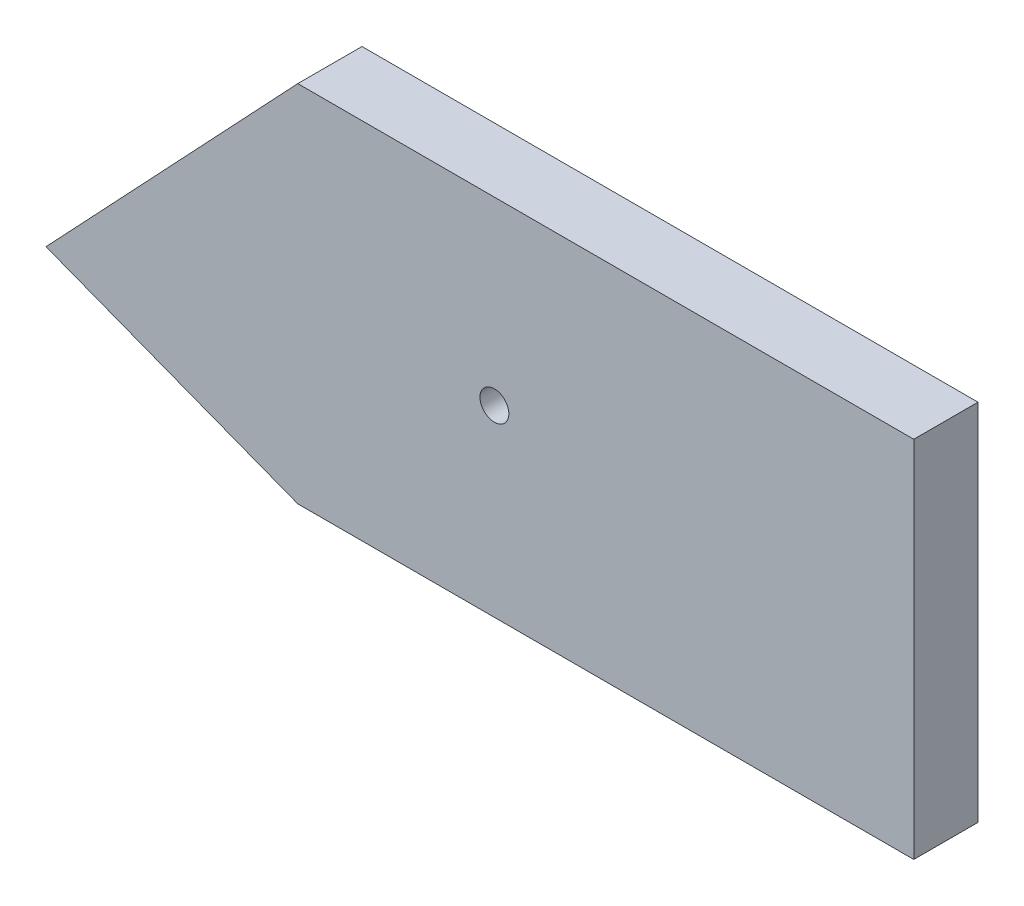
ISO-10303-21;
HEADER;
FILE_DESCRIPTION(('STEP AP214'),'2;1');
FILE_NAME('part.step','',(''),(''),'','','');
FILE_SCHEMA(('AUTOMOTIVE_DESIGN { 1 0 10303 214 1 1 1 1 }'));
ENDSEC;
DATA;
#1=APPLICATION_CONTEXT('core data for automotive mechanical design processes');
#2=APPLICATION_PROTOCOL_DEFINITION('international standard','automotive_design',2000,#1);
#3=PRODUCT_CONTEXT('',#1,'mechanical');
#4=PRODUCT('Part','Part','',(#3));
#5=PRODUCT_RELATED_PRODUCT_CATEGORY('part','',(#4));
#6=PRODUCT_DEFINITION_FORMATION('','',#4);
#7=PRODUCT_DEFINITION_CONTEXT('part definition',#1,'design');
#8=PRODUCT_DEFINITION('design','',#6,#7);
#9=PRODUCT_DEFINITION_SHAPE('','',#8);
#10=(LENGTH_UNIT() NAMED_UNIT(*) SI_UNIT(.MILLI.,.METRE.));
#11=(NAMED_UNIT(*) PLANE_ANGLE_UNIT() SI_UNIT($,.RADIAN.));
#12=(NAMED_UNIT(*) SI_UNIT($,.STERADIAN.) SOLID_ANGLE_UNIT());
#13=UNCERTAINTY_MEASURE_WITH_UNIT(LENGTH_MEASURE(1.E-05),#10,'distance_accuracy_value','');
#14=(GEOMETRIC_REPRESENTATION_CONTEXT(3) GLOBAL_UNCERTAINTY_ASSIGNED_CONTEXT((#13)) GLOBAL_UNIT_ASSIGNED_CONTEXT((#10,
#11,#12)) REPRESENTATION_CONTEXT('',''));
#15=CARTESIAN_POINT('',(0.,0.,0.));
#16=DIRECTION('',(0.,0.,1.));
#17=DIRECTION('',(1.,0.,0.));
#18=AXIS2_PLACEMENT_3D('',#15,#16,#17);
#19=CARTESIAN_POINT('',(-460.979412648812,-194.929034047607,10.));
#20=DIRECTION('',(-1.,0.,0.));
#21=DIRECTION('',(0.,0.,1.));
#22=AXIS2_PLACEMENT_3D('',#19,#20,#21);
#23=PLANE('',#22);
#24=DIRECTION('',(0.,1.,0.));
#25=VECTOR('',#24,1.);
#26=CARTESIAN_POINT('',(-460.979412648812,-194.929034047607,0.));
#27=LINE('',#26,#25);
#28=CARTESIAN_POINT('',(-460.979412648812,-194.929034047607,0.));
#29=VERTEX_POINT('',#28);
#30=CARTESIAN_POINT('',(-460.979412648812,-138.268279633482,0.));
#31=VERTEX_POINT('',#30);
#32=EDGE_CURVE('E120',#29,#31,#27,.T.);
#33=ORIENTED_EDGE('',*,*,#32,.T.);
#34=DIRECTION('',(0.,0.,-1.));
#35=VECTOR('',#34,1.);
#36=CARTESIAN_POINT('',(-460.979412648812,-138.268279633482,10.));
#37=LINE('',#36,#35);
#38=CARTESIAN_POINT('',(-460.979412648812,-138.268279633482,10.));
#39=VERTEX_POINT('',#38);
#40=EDGE_CURVE('E11',#39,#31,#37,.T.);
#41=ORIENTED_EDGE('',*,*,#40,.F.);
#42=DIRECTION('',(0.,1.,0.));
#43=VECTOR('',#42,1.);
#44=CARTESIAN_POINT('',(-460.979412648812,-194.929034047607,10.));
#45=LINE('',#44,#43);
#46=CARTESIAN_POINT('',(-460.979412648812,-194.929034047607,10.));
#47=VERTEX_POINT('',#46);
#48=EDGE_CURVE('E134',#47,#39,#45,.T.);
#49=ORIENTED_EDGE('',*,*,#48,.F.);
#50=DIRECTION('',(0.,0.,-1.));
#51=VECTOR('',#50,1.);
#52=CARTESIAN_POINT('',(-460.979412648812,-194.929034047607,10.));
#53=LINE('',#52,#51);
#54=EDGE_CURVE('E116',#47,#29,#53,.T.);
#55=ORIENTED_EDGE('',*,*,#54,.T.);
#56=EDGE_LOOP('',(#33,#41,#49,#55));
#57=FACE_BOUND('',#56,.T.);
#58=ADVANCED_FACE('F40',(#57),#23,.F.);
#59=CARTESIAN_POINT('',(-460.979412648812,-138.268279633482,10.));
#60=DIRECTION('',(0.,-1.,0.));
#61=DIRECTION('',(0.,0.,-1.));
#62=AXIS2_PLACEMENT_3D('',#59,#60,#61);
#63=PLANE('',#62);
#64=DIRECTION('',(-1.,0.,0.));
#65=VECTOR('',#64,1.);
#66=CARTESIAN_POINT('',(-460.979412648812,-138.268279633482,0.));
#67=LINE('',#66,#65);
#68=CARTESIAN_POINT('',(-556.886836404831,-138.268279633482,0.));
#69=VERTEX_POINT('',#68);
#70=EDGE_CURVE('E124',#31,#69,#67,.T.);
#71=ORIENTED_EDGE('',*,*,#70,.T.);
#72=DIRECTION('',(0.,0.,-1.));
#73=VECTOR('',#72,1.);
#74=CARTESIAN_POINT('',(-556.886836404831,-138.268279633482,10.));
#75=LINE('',#74,#73);
#76=CARTESIAN_POINT('',(-556.886836404831,-138.268279633482,10.));
#77=VERTEX_POINT('',#76);
#78=EDGE_CURVE('E49',#77,#69,#75,.T.);
#79=ORIENTED_EDGE('',*,*,#78,.F.);
#80=DIRECTION('',(-1.,0.,0.));
#81=VECTOR('',#80,1.);
#82=CARTESIAN_POINT('',(-460.979412648812,-138.268279633482,10.));
#83=LINE('',#82,#81);
#84=EDGE_CURVE('E91',#39,#77,#83,.T.);
#85=ORIENTED_EDGE('',*,*,#84,.F.);
#86=ORIENTED_EDGE('',*,*,#40,.T.);
#87=EDGE_LOOP('',(#71,#79,#85,#86));
#88=FACE_BOUND('',#87,.T.);
#89=ADVANCED_FACE('F158',(#88),#63,.F.);
#90=CARTESIAN_POINT('',(-556.886836404831,-138.268279633482,10.));
#91=DIRECTION('',(0.727697954606059,-0.68589772332481,0.));
#92=DIRECTION('',(0.68589772332481,0.727697954606059,0.));
#93=AXIS2_PLACEMENT_3D('',#90,#91,#92);
#94=PLANE('',#93);
#95=DIRECTION('',(-0.68589772332481,-0.727697954606059,0.));
#96=VECTOR('',#95,1.);
#97=CARTESIAN_POINT('',(-556.886836404831,-138.268279633482,0.));
#98=LINE('',#97,#96);
#99=CARTESIAN_POINT('',(-596.082218436845,-179.852321050678,0.));
#100=VERTEX_POINT('',#99);
#101=EDGE_CURVE('E107',#69,#100,#98,.T.);
#102=ORIENTED_EDGE('',*,*,#101,.T.);
#103=DIRECTION('',(0.,0.,-1.));
#104=VECTOR('',#103,1.);
#105=CARTESIAN_POINT('',(-596.082218436845,-179.852321050678,10.));
#106=LINE('',#105,#104);
#107=CARTESIAN_POINT('',(-596.082218436845,-179.852321050678,10.));
#108=VERTEX_POINT('',#107);
#109=EDGE_CURVE('E104',#108,#100,#106,.T.);
#110=ORIENTED_EDGE('',*,*,#109,.F.);
#111=DIRECTION('',(-0.68589772332481,-0.727697954606059,0.));
#112=VECTOR('',#111,1.);
#113=CARTESIAN_POINT('',(-556.886836404831,-138.268279633482,10.));
#114=LINE('',#113,#112);
#115=EDGE_CURVE('E95',#77,#108,#114,.T.);
#116=ORIENTED_EDGE('',*,*,#115,.F.);
#117=ORIENTED_EDGE('',*,*,#78,.T.);
#118=EDGE_LOOP('',(#102,#110,#116,#117));
#119=FACE_BOUND('',#118,.T.);
#120=ADVANCED_FACE('F105',(#119),#94,.F.);
#121=CARTESIAN_POINT('',(-596.082218436845,-179.852321050678,10.));
#122=DIRECTION('',(0.359011565041303,0.933333111041601,0.));
#123=DIRECTION('',(-0.933333111041601,0.359011565041303,0.));
#124=AXIS2_PLACEMENT_3D('',#121,#122,#123);
#125=PLANE('',#124);
#126=DIRECTION('',(0.933333111041601,-0.359011565041303,0.));
#127=VECTOR('',#126,1.);
#128=CARTESIAN_POINT('',(-596.082218436845,-179.852321050678,0.));
#129=LINE('',#128,#127);
#130=CARTESIAN_POINT('',(-556.886836404831,-194.929034047607,0.));
#131=VERTEX_POINT('',#130);
#132=EDGE_CURVE('E77',#100,#131,#129,.T.);
#133=ORIENTED_EDGE('',*,*,#132,.T.);
#134=DIRECTION('',(0.,0.,-1.));
#135=VECTOR('',#134,1.);
#136=CARTESIAN_POINT('',(-556.886836404831,-194.929034047607,10.));
#137=LINE('',#136,#135);
#138=CARTESIAN_POINT('',(-556.886836404831,-194.929034047607,10.));
#139=VERTEX_POINT('',#138);
#140=EDGE_CURVE('E109',#139,#131,#137,.T.);
#141=ORIENTED_EDGE('',*,*,#140,.F.);
#142=DIRECTION('',(0.933333111041601,-0.359011565041303,0.));
#143=VECTOR('',#142,1.);
#144=CARTESIAN_POINT('',(-596.082218436845,-179.852321050678,10.));
#145=LINE('',#144,#143);
#146=EDGE_CURVE('E99',#108,#139,#145,.T.);
#147=ORIENTED_EDGE('',*,*,#146,.F.);
#148=ORIENTED_EDGE('',*,*,#109,.T.);
#149=EDGE_LOOP('',(#133,#141,#147,#148));
#150=FACE_BOUND('',#149,.T.);
#151=ADVANCED_FACE('F111',(#150),#125,.F.);
#152=CARTESIAN_POINT('',(-556.886836404831,-194.929034047607,10.));
#153=DIRECTION('',(0.,1.,0.));
#154=DIRECTION('',(0.,0.,1.));
#155=AXIS2_PLACEMENT_3D('',#152,#153,#154);
#156=PLANE('',#155);
#157=DIRECTION('',(1.,0.,0.));
#158=VECTOR('',#157,1.);
#159=CARTESIAN_POINT('',(-556.886836404831,-194.929034047607,0.));
#160=LINE('',#159,#158);
#161=EDGE_CURVE('E83',#131,#29,#160,.T.);
#162=ORIENTED_EDGE('',*,*,#161,.T.);
#163=ORIENTED_EDGE('',*,*,#54,.F.);
#164=DIRECTION('',(1.,0.,0.));
#165=VECTOR('',#164,1.);
#166=CARTESIAN_POINT('',(-556.886836404831,-194.929034047607,10.));
#167=LINE('',#166,#165);
#168=EDGE_CURVE('E57',#139,#47,#167,.T.);
#169=ORIENTED_EDGE('',*,*,#168,.F.);
#170=ORIENTED_EDGE('',*,*,#140,.T.);
#171=EDGE_LOOP('',(#162,#163,#169,#170));
#172=FACE_BOUND('',#171,.T.);
#173=ADVANCED_FACE('F146',(#172),#156,.F.);
#174=CARTESIAN_POINT('',(0.,0.,10.));
#175=DIRECTION('',(0.,0.,1.));
#176=DIRECTION('',(1.,0.,0.));
#177=AXIS2_PLACEMENT_3D('',#174,#175,#176);
#178=PLANE('',#177);
#179=CARTESIAN_POINT('',(-526.271300891591,-166.364880694939,10.));
#180=DIRECTION('',(0.,0.,1.));
#181=DIRECTION('',(1.,0.,0.));
#182=AXIS2_PLACEMENT_3D('',#179,#180,#181);
#183=CIRCLE('',#182,2.24999999999997);
#184=CARTESIAN_POINT('',(-524.021300891591,-166.364880694939,10.));
#185=VERTEX_POINT('',#184);
#186=EDGE_CURVE('E235',#185,#185,#183,.T.);
#187=ORIENTED_EDGE('',*,*,#186,.F.);
#188=EDGE_LOOP('',(#187));
#189=FACE_BOUND('',#188,.T.);
#190=ORIENTED_EDGE('',*,*,#48,.T.);
#191=ORIENTED_EDGE('',*,*,#84,.T.);
#192=ORIENTED_EDGE('',*,*,#115,.T.);
#193=ORIENTED_EDGE('',*,*,#146,.T.);
#194=ORIENTED_EDGE('',*,*,#168,.T.);
#195=EDGE_LOOP('',(#190,#191,#192,#193,#194));
#196=FACE_BOUND('',#195,.T.);
#197=ADVANCED_FACE('F97',(#189,#196),#178,.T.);
#198=CARTESIAN_POINT('',(0.,0.,0.));
#199=DIRECTION('',(0.,0.,1.));
#200=DIRECTION('',(1.,0.,0.));
#201=AXIS2_PLACEMENT_3D('',#198,#199,#200);
#202=PLANE('',#201);
#203=CARTESIAN_POINT('',(-526.271300891591,-166.364880694939,0.));
#204=DIRECTION('',(0.,0.,1.));
#205=DIRECTION('',(1.,0.,0.));
#206=AXIS2_PLACEMENT_3D('',#203,#204,#205);
#207=CIRCLE('',#206,2.24999999999997);
#208=CARTESIAN_POINT('',(-524.021300891591,-166.364880694939,0.));
#209=VERTEX_POINT('',#208);
#210=EDGE_CURVE('E125',#209,#209,#207,.T.);
#211=ORIENTED_EDGE('',*,*,#210,.T.);
#212=EDGE_LOOP('',(#211));
#213=FACE_BOUND('',#212,.T.);
#214=ORIENTED_EDGE('',*,*,#32,.F.);
#215=ORIENTED_EDGE('',*,*,#161,.F.);
#216=ORIENTED_EDGE('',*,*,#132,.F.);
#217=ORIENTED_EDGE('',*,*,#101,.F.);
#218=ORIENTED_EDGE('',*,*,#70,.F.);
#219=EDGE_LOOP('',(#214,#215,#216,#217,#218));
#220=FACE_BOUND('',#219,.T.);
#221=ADVANCED_FACE('F142',(#213,#220),#202,.F.);
#222=CARTESIAN_POINT('',(-526.271300891591,-166.364880694939,10.));
#223=DIRECTION('',(0.,0.,1.));
#224=DIRECTION('',(1.,0.,0.));
#225=AXIS2_PLACEMENT_3D('',#222,#223,#224);
#226=CYLINDRICAL_SURFACE('',#225,2.24999999999997);
#227=ORIENTED_EDGE('',*,*,#210,.F.);
#228=EDGE_LOOP('',(#227));
#229=FACE_BOUND('',#228,.T.);
#230=ORIENTED_EDGE('',*,*,#186,.T.);
#231=EDGE_LOOP('',(#230));
#232=FACE_BOUND('',#231,.T.);
#233=ADVANCED_FACE('F191',(#229,#232),#226,.F.);
#234=CLOSED_SHELL('',(#58,#89,#120,#151,#173,#197,#221,#233));
#235=MANIFOLD_SOLID_BREP('B2',#234);
#236=ADVANCED_BREP_SHAPE_REPRESENTATION('',(#18,#235),#14);
#237=SHAPE_DEFINITION_REPRESENTATION(#9,#236);
ENDSEC;
END-ISO-10303-21;
